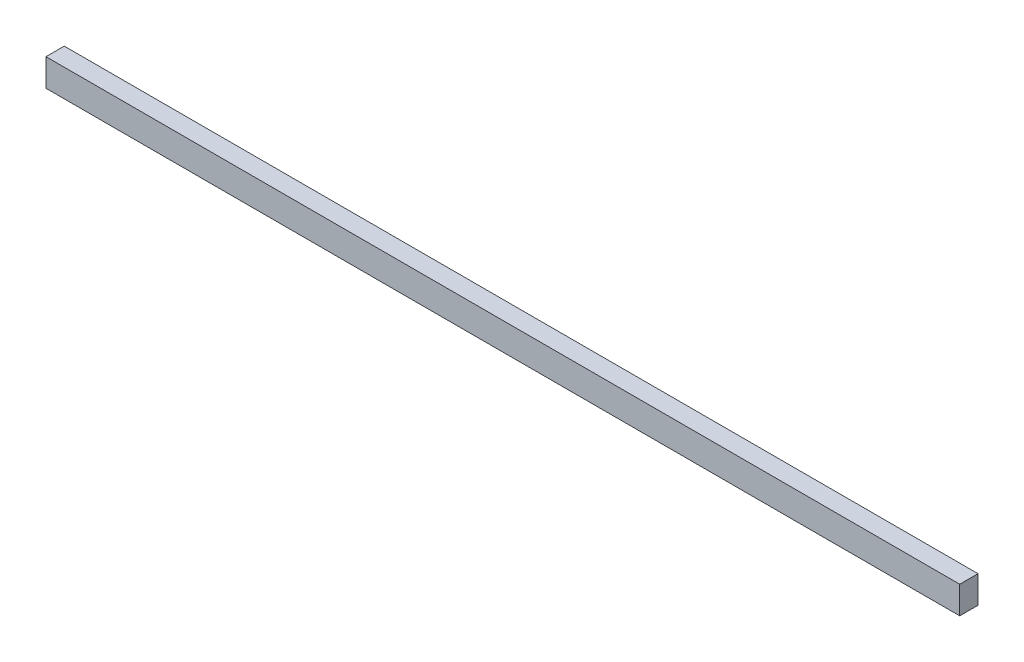
ISO-10303-21;
HEADER;
FILE_DESCRIPTION(('STEP AP214'),'2;1');
FILE_NAME('part.step','',(''),(''),'','','');
FILE_SCHEMA(('AUTOMOTIVE_DESIGN { 1 0 10303 214 1 1 1 1 }'));
ENDSEC;
DATA;
#1=APPLICATION_CONTEXT('core data for automotive mechanical design processes');
#2=APPLICATION_PROTOCOL_DEFINITION('international standard','automotive_design',2000,#1);
#3=PRODUCT_CONTEXT('',#1,'mechanical');
#4=PRODUCT('Part','Part','',(#3));
#5=PRODUCT_RELATED_PRODUCT_CATEGORY('part','',(#4));
#6=PRODUCT_DEFINITION_FORMATION('','',#4);
#7=PRODUCT_DEFINITION_CONTEXT('part definition',#1,'design');
#8=PRODUCT_DEFINITION('design','',#6,#7);
#9=PRODUCT_DEFINITION_SHAPE('','',#8);
#10=(LENGTH_UNIT() NAMED_UNIT(*) SI_UNIT(.MILLI.,.METRE.));
#11=(NAMED_UNIT(*) PLANE_ANGLE_UNIT() SI_UNIT($,.RADIAN.));
#12=(NAMED_UNIT(*) SI_UNIT($,.STERADIAN.) SOLID_ANGLE_UNIT());
#13=UNCERTAINTY_MEASURE_WITH_UNIT(LENGTH_MEASURE(1.E-05),#10,'distance_accuracy_value','');
#14=(GEOMETRIC_REPRESENTATION_CONTEXT(3) GLOBAL_UNCERTAINTY_ASSIGNED_CONTEXT((#13)) GLOBAL_UNIT_ASSIGNED_CONTEXT((#10,
#11,#12)) REPRESENTATION_CONTEXT('',''));
#15=CARTESIAN_POINT('',(0.,0.,0.));
#16=DIRECTION('',(0.,0.,1.));
#17=DIRECTION('',(1.,0.,0.));
#18=AXIS2_PLACEMENT_3D('',#15,#16,#17);
#19=CARTESIAN_POINT('',(4.65606159594092,3.,35.4062486909104));
#20=DIRECTION('',(1.,0.,0.));
#21=DIRECTION('',(0.,0.,-1.));
#22=AXIS2_PLACEMENT_3D('',#19,#20,#21);
#23=PLANE('',#22);
#24=DIRECTION('',(0.,0.,1.));
#25=VECTOR('',#24,1.);
#26=CARTESIAN_POINT('',(4.65606159594092,0.,35.4062486909104));
#27=LINE('',#26,#25);
#28=CARTESIAN_POINT('',(4.65606159594092,0.,35.4062486909104));
#29=VERTEX_POINT('',#28);
#30=CARTESIAN_POINT('',(4.65606159594092,0.,37.4062486909104));
#31=VERTEX_POINT('',#30);
#32=EDGE_CURVE('E100',#29,#31,#27,.T.);
#33=ORIENTED_EDGE('',*,*,#32,.T.);
#34=DIRECTION('',(0.,-1.,0.));
#35=VECTOR('',#34,1.);
#36=CARTESIAN_POINT('',(4.65606159594092,3.,37.4062486909104));
#37=LINE('',#36,#35);
#38=CARTESIAN_POINT('',(4.65606159594092,3.,37.4062486909104));
#39=VERTEX_POINT('',#38);
#40=EDGE_CURVE('E11',#39,#31,#37,.T.);
#41=ORIENTED_EDGE('',*,*,#40,.F.);
#42=DIRECTION('',(0.,0.,1.));
#43=VECTOR('',#42,1.);
#44=CARTESIAN_POINT('',(4.65606159594092,3.,35.4062486909104));
#45=LINE('',#44,#43);
#46=CARTESIAN_POINT('',(4.65606159594092,3.,35.4062486909104));
#47=VERTEX_POINT('',#46);
#48=EDGE_CURVE('E88',#47,#39,#45,.T.);
#49=ORIENTED_EDGE('',*,*,#48,.F.);
#50=DIRECTION('',(0.,-1.,0.));
#51=VECTOR('',#50,1.);
#52=CARTESIAN_POINT('',(4.65606159594092,3.,35.4062486909104));
#53=LINE('',#52,#51);
#54=EDGE_CURVE('E96',#47,#29,#53,.T.);
#55=ORIENTED_EDGE('',*,*,#54,.T.);
#56=EDGE_LOOP('',(#33,#41,#49,#55));
#57=FACE_BOUND('',#56,.T.);
#58=ADVANCED_FACE('F37',(#57),#23,.F.);
#59=CARTESIAN_POINT('',(4.65606159594092,3.,37.4062486909104));
#60=DIRECTION('',(0.,0.,-1.));
#61=DIRECTION('',(-1.,0.,0.));
#62=AXIS2_PLACEMENT_3D('',#59,#60,#61);
#63=PLANE('',#62);
#64=DIRECTION('',(1.,0.,0.));
#65=VECTOR('',#64,1.);
#66=CARTESIAN_POINT('',(4.65606159594092,0.,37.4062486909104));
#67=LINE('',#66,#65);
#68=CARTESIAN_POINT('',(104.656061595941,0.,37.4062486909104));
#69=VERTEX_POINT('',#68);
#70=EDGE_CURVE('E92',#31,#69,#67,.T.);
#71=ORIENTED_EDGE('',*,*,#70,.T.);
#72=DIRECTION('',(0.,-1.,0.));
#73=VECTOR('',#72,1.);
#74=CARTESIAN_POINT('',(104.656061595941,3.,37.4062486909104));
#75=LINE('',#74,#73);
#76=CARTESIAN_POINT('',(104.656061595941,3.,37.4062486909104));
#77=VERTEX_POINT('',#76);
#78=EDGE_CURVE('E45',#77,#69,#75,.T.);
#79=ORIENTED_EDGE('',*,*,#78,.F.);
#80=DIRECTION('',(1.,0.,0.));
#81=VECTOR('',#80,1.);
#82=CARTESIAN_POINT('',(4.65606159594092,3.,37.4062486909104));
#83=LINE('',#82,#81);
#84=EDGE_CURVE('E83',#39,#77,#83,.T.);
#85=ORIENTED_EDGE('',*,*,#84,.F.);
#86=ORIENTED_EDGE('',*,*,#40,.T.);
#87=EDGE_LOOP('',(#71,#79,#85,#86));
#88=FACE_BOUND('',#87,.T.);
#89=ADVANCED_FACE('F91',(#88),#63,.F.);
#90=CARTESIAN_POINT('',(104.656061595941,3.,35.4062486909104));
#91=DIRECTION('',(-1.,0.,0.));
#92=DIRECTION('',(0.,0.,1.));
#93=AXIS2_PLACEMENT_3D('',#90,#91,#92);
#94=PLANE('',#93);
#95=DIRECTION('',(0.,0.,-1.));
#96=VECTOR('',#95,1.);
#97=CARTESIAN_POINT('',(104.656061595941,0.,35.4062486909104));
#98=LINE('',#97,#96);
#99=CARTESIAN_POINT('',(104.656061595941,0.,35.4062486909104));
#100=VERTEX_POINT('',#99);
#101=EDGE_CURVE('E70',#69,#100,#98,.T.);
#102=ORIENTED_EDGE('',*,*,#101,.T.);
#103=DIRECTION('',(0.,-1.,0.));
#104=VECTOR('',#103,1.);
#105=CARTESIAN_POINT('',(104.656061595941,3.,35.4062486909104));
#106=LINE('',#105,#104);
#107=CARTESIAN_POINT('',(104.656061595941,3.,35.4062486909104));
#108=VERTEX_POINT('',#107);
#109=EDGE_CURVE('E93',#108,#100,#106,.T.);
#110=ORIENTED_EDGE('',*,*,#109,.F.);
#111=DIRECTION('',(0.,0.,-1.));
#112=VECTOR('',#111,1.);
#113=CARTESIAN_POINT('',(104.656061595941,3.,35.4062486909104));
#114=LINE('',#113,#112);
#115=EDGE_CURVE('E86',#77,#108,#114,.T.);
#116=ORIENTED_EDGE('',*,*,#115,.F.);
#117=ORIENTED_EDGE('',*,*,#78,.T.);
#118=EDGE_LOOP('',(#102,#110,#116,#117));
#119=FACE_BOUND('',#118,.T.);
#120=ADVANCED_FACE('F94',(#119),#94,.F.);
#121=CARTESIAN_POINT('',(4.65606159594092,3.,35.4062486909104));
#122=DIRECTION('',(0.,0.,1.));
#123=DIRECTION('',(1.,0.,0.));
#124=AXIS2_PLACEMENT_3D('',#121,#122,#123);
#125=PLANE('',#124);
#126=DIRECTION('',(-1.,0.,0.));
#127=VECTOR('',#126,1.);
#128=CARTESIAN_POINT('',(4.65606159594092,0.,35.4062486909104));
#129=LINE('',#128,#127);
#130=EDGE_CURVE('E76',#100,#29,#129,.T.);
#131=ORIENTED_EDGE('',*,*,#130,.T.);
#132=ORIENTED_EDGE('',*,*,#54,.F.);
#133=DIRECTION('',(-1.,0.,0.));
#134=VECTOR('',#133,1.);
#135=CARTESIAN_POINT('',(4.65606159594092,3.,35.4062486909104));
#136=LINE('',#135,#134);
#137=EDGE_CURVE('E53',#108,#47,#136,.T.);
#138=ORIENTED_EDGE('',*,*,#137,.F.);
#139=ORIENTED_EDGE('',*,*,#109,.T.);
#140=EDGE_LOOP('',(#131,#132,#138,#139));
#141=FACE_BOUND('',#140,.T.);
#142=ADVANCED_FACE('F107',(#141),#125,.F.);
#143=CARTESIAN_POINT('',(0.,3.,0.));
#144=DIRECTION('',(0.,1.,0.));
#145=DIRECTION('',(0.,0.,1.));
#146=AXIS2_PLACEMENT_3D('',#143,#144,#145);
#147=PLANE('',#146);
#148=ORIENTED_EDGE('',*,*,#48,.T.);
#149=ORIENTED_EDGE('',*,*,#84,.T.);
#150=ORIENTED_EDGE('',*,*,#115,.T.);
#151=ORIENTED_EDGE('',*,*,#137,.T.);
#152=EDGE_LOOP('',(#148,#149,#150,#151));
#153=FACE_BOUND('',#152,.T.);
#154=ADVANCED_FACE('F84',(#153),#147,.T.);
#155=CARTESIAN_POINT('',(0.,0.,0.));
#156=DIRECTION('',(0.,1.,0.));
#157=DIRECTION('',(0.,0.,1.));
#158=AXIS2_PLACEMENT_3D('',#155,#156,#157);
#159=PLANE('',#158);
#160=ORIENTED_EDGE('',*,*,#32,.F.);
#161=ORIENTED_EDGE('',*,*,#130,.F.);
#162=ORIENTED_EDGE('',*,*,#101,.F.);
#163=ORIENTED_EDGE('',*,*,#70,.F.);
#164=EDGE_LOOP('',(#160,#161,#162,#163));
#165=FACE_BOUND('',#164,.T.);
#166=ADVANCED_FACE('F110',(#165),#159,.F.);
#167=CLOSED_SHELL('',(#58,#89,#120,#142,#154,#166));
#168=MANIFOLD_SOLID_BREP('B2',#167);
#169=ADVANCED_BREP_SHAPE_REPRESENTATION('',(#18,#168),#14);
#170=SHAPE_DEFINITION_REPRESENTATION(#9,#169);
ENDSEC;
END-ISO-10303-21;
